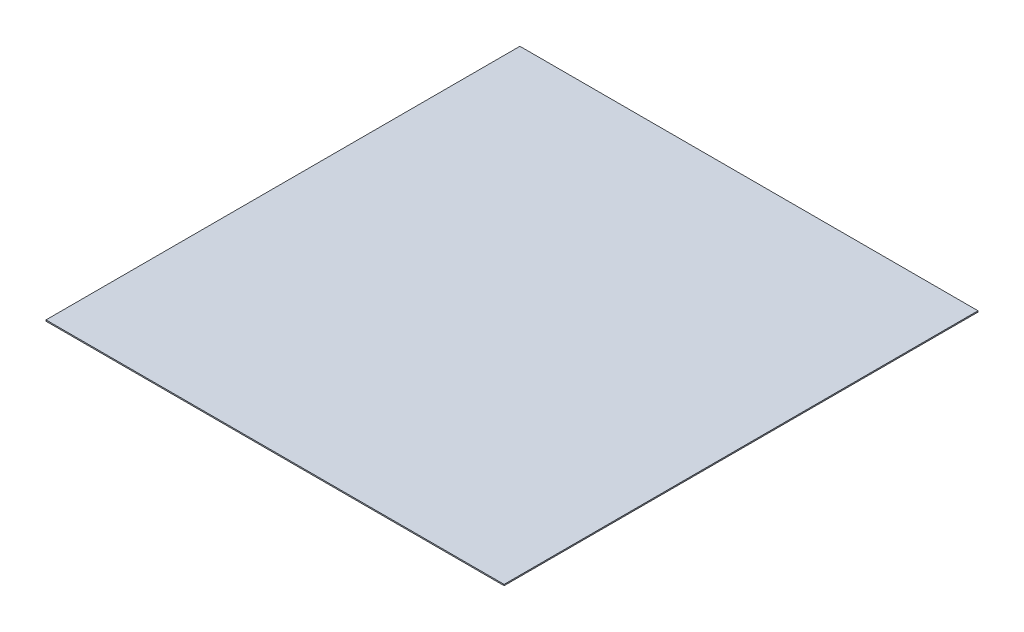
ISO-10303-21;
HEADER;
FILE_DESCRIPTION(('STEP AP214'),'2;1');
FILE_NAME('part.step','',(''),(''),'','','');
FILE_SCHEMA(('AUTOMOTIVE_DESIGN { 1 0 10303 214 1 1 1 1 }'));
ENDSEC;
DATA;
#1=APPLICATION_CONTEXT('core data for automotive mechanical design processes');
#2=APPLICATION_PROTOCOL_DEFINITION('international standard','automotive_design',2000,#1);
#3=PRODUCT_CONTEXT('',#1,'mechanical');
#4=PRODUCT('Part','Part','',(#3));
#5=PRODUCT_RELATED_PRODUCT_CATEGORY('part','',(#4));
#6=PRODUCT_DEFINITION_FORMATION('','',#4);
#7=PRODUCT_DEFINITION_CONTEXT('part definition',#1,'design');
#8=PRODUCT_DEFINITION('design','',#6,#7);
#9=PRODUCT_DEFINITION_SHAPE('','',#8);
#10=(LENGTH_UNIT() NAMED_UNIT(*) SI_UNIT(.MILLI.,.METRE.));
#11=(NAMED_UNIT(*) PLANE_ANGLE_UNIT() SI_UNIT($,.RADIAN.));
#12=(NAMED_UNIT(*) SI_UNIT($,.STERADIAN.) SOLID_ANGLE_UNIT());
#13=UNCERTAINTY_MEASURE_WITH_UNIT(LENGTH_MEASURE(1.E-05),#10,'distance_accuracy_value','');
#14=(GEOMETRIC_REPRESENTATION_CONTEXT(3) GLOBAL_UNCERTAINTY_ASSIGNED_CONTEXT((#13)) GLOBAL_UNIT_ASSIGNED_CONTEXT((#10,
#11,#12)) REPRESENTATION_CONTEXT('',''));
#15=CARTESIAN_POINT('',(0.,0.,0.));
#16=DIRECTION('',(0.,0.,1.));
#17=DIRECTION('',(1.,0.,0.));
#18=AXIS2_PLACEMENT_3D('',#15,#16,#17);
#19=CARTESIAN_POINT('',(-9.6048,0.05,-9.936));
#20=DIRECTION('',(1.,0.,0.));
#21=DIRECTION('',(0.,0.,-1.));
#22=AXIS2_PLACEMENT_3D('',#19,#20,#21);
#23=PLANE('',#22);
#24=DIRECTION('',(0.,0.,1.));
#25=VECTOR('',#24,1.);
#26=CARTESIAN_POINT('',(-9.6048,0.,-9.936));
#27=LINE('',#26,#25);
#28=CARTESIAN_POINT('',(-9.6048,0.,-9.936));
#29=VERTEX_POINT('',#28);
#30=CARTESIAN_POINT('',(-9.6048,0.,9.936));
#31=VERTEX_POINT('',#30);
#32=EDGE_CURVE('E97',#29,#31,#27,.T.);
#33=ORIENTED_EDGE('',*,*,#32,.T.);
#34=DIRECTION('',(0.,-1.,0.));
#35=VECTOR('',#34,1.);
#36=CARTESIAN_POINT('',(-9.6048,0.05,9.936));
#37=LINE('',#36,#35);
#38=CARTESIAN_POINT('',(-9.6048,0.05,9.936));
#39=VERTEX_POINT('',#38);
#40=EDGE_CURVE('E11',#39,#31,#37,.T.);
#41=ORIENTED_EDGE('',*,*,#40,.F.);
#42=DIRECTION('',(0.,0.,1.));
#43=VECTOR('',#42,1.);
#44=CARTESIAN_POINT('',(-9.6048,0.05,-9.936));
#45=LINE('',#44,#43);
#46=CARTESIAN_POINT('',(-9.6048,0.05,-9.936));
#47=VERTEX_POINT('',#46);
#48=EDGE_CURVE('E85',#47,#39,#45,.T.);
#49=ORIENTED_EDGE('',*,*,#48,.F.);
#50=DIRECTION('',(0.,-1.,0.));
#51=VECTOR('',#50,1.);
#52=CARTESIAN_POINT('',(-9.6048,0.05,-9.936));
#53=LINE('',#52,#51);
#54=EDGE_CURVE('E93',#47,#29,#53,.T.);
#55=ORIENTED_EDGE('',*,*,#54,.T.);
#56=EDGE_LOOP('',(#33,#41,#49,#55));
#57=FACE_BOUND('',#56,.T.);
#58=ADVANCED_FACE('F34',(#57),#23,.F.);
#59=CARTESIAN_POINT('',(-9.6048,0.05,9.936));
#60=DIRECTION('',(0.,0.,-1.));
#61=DIRECTION('',(-1.,0.,0.));
#62=AXIS2_PLACEMENT_3D('',#59,#60,#61);
#63=PLANE('',#62);
#64=DIRECTION('',(1.,0.,0.));
#65=VECTOR('',#64,1.);
#66=CARTESIAN_POINT('',(-9.6048,0.,9.936));
#67=LINE('',#66,#65);
#68=CARTESIAN_POINT('',(9.6048,0.,9.936));
#69=VERTEX_POINT('',#68);
#70=EDGE_CURVE('E89',#31,#69,#67,.T.);
#71=ORIENTED_EDGE('',*,*,#70,.T.);
#72=DIRECTION('',(0.,-1.,0.));
#73=VECTOR('',#72,1.);
#74=CARTESIAN_POINT('',(9.6048,0.05,9.936));
#75=LINE('',#74,#73);
#76=CARTESIAN_POINT('',(9.6048,0.05,9.936));
#77=VERTEX_POINT('',#76);
#78=EDGE_CURVE('E42',#77,#69,#75,.T.);
#79=ORIENTED_EDGE('',*,*,#78,.F.);
#80=DIRECTION('',(1.,0.,0.));
#81=VECTOR('',#80,1.);
#82=CARTESIAN_POINT('',(-9.6048,0.05,9.936));
#83=LINE('',#82,#81);
#84=EDGE_CURVE('E80',#39,#77,#83,.T.);
#85=ORIENTED_EDGE('',*,*,#84,.F.);
#86=ORIENTED_EDGE('',*,*,#40,.T.);
#87=EDGE_LOOP('',(#71,#79,#85,#86));
#88=FACE_BOUND('',#87,.T.);
#89=ADVANCED_FACE('F88',(#88),#63,.F.);
#90=CARTESIAN_POINT('',(9.6048,0.05,-9.936));
#91=DIRECTION('',(-1.,0.,0.));
#92=DIRECTION('',(0.,0.,1.));
#93=AXIS2_PLACEMENT_3D('',#90,#91,#92);
#94=PLANE('',#93);
#95=DIRECTION('',(0.,0.,-1.));
#96=VECTOR('',#95,1.);
#97=CARTESIAN_POINT('',(9.6048,0.,-9.936));
#98=LINE('',#97,#96);
#99=CARTESIAN_POINT('',(9.6048,0.,-9.936));
#100=VERTEX_POINT('',#99);
#101=EDGE_CURVE('E67',#69,#100,#98,.T.);
#102=ORIENTED_EDGE('',*,*,#101,.T.);
#103=DIRECTION('',(0.,-1.,0.));
#104=VECTOR('',#103,1.);
#105=CARTESIAN_POINT('',(9.6048,0.05,-9.936));
#106=LINE('',#105,#104);
#107=CARTESIAN_POINT('',(9.6048,0.05,-9.936));
#108=VERTEX_POINT('',#107);
#109=EDGE_CURVE('E90',#108,#100,#106,.T.);
#110=ORIENTED_EDGE('',*,*,#109,.F.);
#111=DIRECTION('',(0.,0.,-1.));
#112=VECTOR('',#111,1.);
#113=CARTESIAN_POINT('',(9.6048,0.05,-9.936));
#114=LINE('',#113,#112);
#115=EDGE_CURVE('E83',#77,#108,#114,.T.);
#116=ORIENTED_EDGE('',*,*,#115,.F.);
#117=ORIENTED_EDGE('',*,*,#78,.T.);
#118=EDGE_LOOP('',(#102,#110,#116,#117));
#119=FACE_BOUND('',#118,.T.);
#120=ADVANCED_FACE('F91',(#119),#94,.F.);
#121=CARTESIAN_POINT('',(-9.6048,0.05,-9.936));
#122=DIRECTION('',(0.,0.,1.));
#123=DIRECTION('',(1.,0.,0.));
#124=AXIS2_PLACEMENT_3D('',#121,#122,#123);
#125=PLANE('',#124);
#126=DIRECTION('',(-1.,0.,0.));
#127=VECTOR('',#126,1.);
#128=CARTESIAN_POINT('',(-9.6048,0.,-9.936));
#129=LINE('',#128,#127);
#130=EDGE_CURVE('E73',#100,#29,#129,.T.);
#131=ORIENTED_EDGE('',*,*,#130,.T.);
#132=ORIENTED_EDGE('',*,*,#54,.F.);
#133=DIRECTION('',(-1.,0.,0.));
#134=VECTOR('',#133,1.);
#135=CARTESIAN_POINT('',(-9.6048,0.05,-9.936));
#136=LINE('',#135,#134);
#137=EDGE_CURVE('E50',#108,#47,#136,.T.);
#138=ORIENTED_EDGE('',*,*,#137,.F.);
#139=ORIENTED_EDGE('',*,*,#109,.T.);
#140=EDGE_LOOP('',(#131,#132,#138,#139));
#141=FACE_BOUND('',#140,.T.);
#142=ADVANCED_FACE('F104',(#141),#125,.F.);
#143=CARTESIAN_POINT('',(-9.6048,0.05,9.936));
#144=DIRECTION('',(0.,1.,0.));
#145=DIRECTION('',(0.,0.,1.));
#146=AXIS2_PLACEMENT_3D('',#143,#144,#145);
#147=PLANE('',#146);
#148=ORIENTED_EDGE('',*,*,#48,.T.);
#149=ORIENTED_EDGE('',*,*,#84,.T.);
#150=ORIENTED_EDGE('',*,*,#115,.T.);
#151=ORIENTED_EDGE('',*,*,#137,.T.);
#152=EDGE_LOOP('',(#148,#149,#150,#151));
#153=FACE_BOUND('',#152,.T.);
#154=ADVANCED_FACE('F81',(#153),#147,.T.);
#155=CARTESIAN_POINT('',(-9.6048,0.,9.936));
#156=DIRECTION('',(0.,1.,0.));
#157=DIRECTION('',(0.,0.,1.));
#158=AXIS2_PLACEMENT_3D('',#155,#156,#157);
#159=PLANE('',#158);
#160=ORIENTED_EDGE('',*,*,#32,.F.);
#161=ORIENTED_EDGE('',*,*,#130,.F.);
#162=ORIENTED_EDGE('',*,*,#101,.F.);
#163=ORIENTED_EDGE('',*,*,#70,.F.);
#164=EDGE_LOOP('',(#160,#161,#162,#163));
#165=FACE_BOUND('',#164,.T.);
#166=ADVANCED_FACE('F107',(#165),#159,.F.);
#167=CLOSED_SHELL('',(#58,#89,#120,#142,#154,#166));
#168=MANIFOLD_SOLID_BREP('B2',#167);
#169=ADVANCED_BREP_SHAPE_REPRESENTATION('',(#18,#168),#14);
#170=SHAPE_DEFINITION_REPRESENTATION(#9,#169);
ENDSEC;
END-ISO-10303-21;
